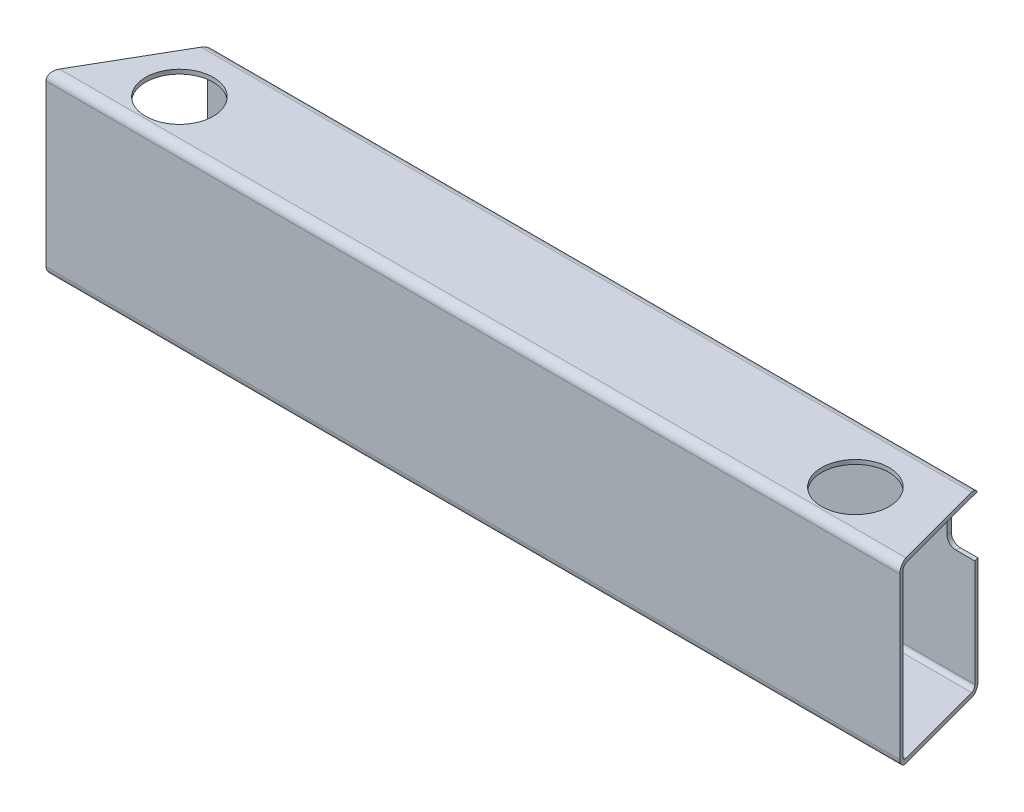
ISO-10303-21;
HEADER;
FILE_DESCRIPTION(('STEP AP214'),'2;1');
FILE_NAME('part.step','',(''),(''),'','','');
FILE_SCHEMA(('AUTOMOTIVE_DESIGN { 1 0 10303 214 1 1 1 1 }'));
ENDSEC;
DATA;
#1=APPLICATION_CONTEXT('core data for automotive mechanical design processes');
#2=APPLICATION_PROTOCOL_DEFINITION('international standard','automotive_design',2000,#1);
#3=PRODUCT_CONTEXT('',#1,'mechanical');
#4=PRODUCT('Part','Part','',(#3));
#5=PRODUCT_RELATED_PRODUCT_CATEGORY('part','',(#4));
#6=PRODUCT_DEFINITION_FORMATION('','',#4);
#7=PRODUCT_DEFINITION_CONTEXT('part definition',#1,'design');
#8=PRODUCT_DEFINITION('design','',#6,#7);
#9=PRODUCT_DEFINITION_SHAPE('','',#8);
#10=(LENGTH_UNIT() NAMED_UNIT(*) SI_UNIT(.MILLI.,.METRE.));
#11=(NAMED_UNIT(*) PLANE_ANGLE_UNIT() SI_UNIT($,.RADIAN.));
#12=(NAMED_UNIT(*) SI_UNIT($,.STERADIAN.) SOLID_ANGLE_UNIT());
#13=UNCERTAINTY_MEASURE_WITH_UNIT(LENGTH_MEASURE(1.E-05),#10,'distance_accuracy_value','');
#14=(GEOMETRIC_REPRESENTATION_CONTEXT(3) GLOBAL_UNCERTAINTY_ASSIGNED_CONTEXT((#13)) GLOBAL_UNIT_ASSIGNED_CONTEXT((#10,
#11,#12)) REPRESENTATION_CONTEXT('',''));
#15=CARTESIAN_POINT('',(0.,0.,0.));
#16=DIRECTION('',(0.,0.,1.));
#17=DIRECTION('',(1.,0.,0.));
#18=AXIS2_PLACEMENT_3D('',#15,#16,#17);
#19=CARTESIAN_POINT('',(63.5,0.,-31.75));
#20=DIRECTION('',(0.,1.,0.));
#21=DIRECTION('',(0.,0.,1.));
#22=AXIS2_PLACEMENT_3D('',#19,#20,#21);
#23=CYLINDRICAL_SURFACE('',#22,24.13);
#24=CARTESIAN_POINT('',(63.5,-123.952,-31.75));
#25=DIRECTION('',(0.,1.,0.));
#26=DIRECTION('',(0.,0.,1.));
#27=AXIS2_PLACEMENT_3D('',#24,#25,#26);
#28=CIRCLE('',#27,24.13);
#29=CARTESIAN_POINT('',(63.5,-123.952,-7.62));
#30=VERTEX_POINT('',#29);
#31=EDGE_CURVE('E269',#30,#30,#28,.F.);
#32=ORIENTED_EDGE('',*,*,#31,.F.);
#33=EDGE_LOOP('',(#32));
#34=FACE_BOUND('',#33,.T.);
#35=CARTESIAN_POINT('',(63.5,-127.,-31.75));
#36=DIRECTION('',(0.,1.,0.));
#37=DIRECTION('',(0.,0.,1.));
#38=AXIS2_PLACEMENT_3D('',#35,#36,#37);
#39=CIRCLE('',#38,24.13);
#40=CARTESIAN_POINT('',(63.5,-127.,-7.62));
#41=VERTEX_POINT('',#40);
#42=EDGE_CURVE('E20',#41,#41,#39,.T.);
#43=ORIENTED_EDGE('',*,*,#42,.F.);
#44=EDGE_LOOP('',(#43));
#45=FACE_BOUND('',#44,.T.);
#46=ADVANCED_FACE('F17',(#34,#45),#23,.F.);
#47=CARTESIAN_POINT('',(546.1,0.,-31.75));
#48=DIRECTION('',(0.,1.,0.));
#49=DIRECTION('',(0.,0.,1.));
#50=AXIS2_PLACEMENT_3D('',#47,#48,#49);
#51=CYLINDRICAL_SURFACE('',#50,24.13);
#52=CARTESIAN_POINT('',(546.1,-123.952,-31.75));
#53=DIRECTION('',(0.,1.,0.));
#54=DIRECTION('',(0.,0.,1.));
#55=AXIS2_PLACEMENT_3D('',#52,#53,#54);
#56=CIRCLE('',#55,24.13);
#57=CARTESIAN_POINT('',(546.1,-123.952,-7.62));
#58=VERTEX_POINT('',#57);
#59=EDGE_CURVE('E265',#58,#58,#56,.F.);
#60=ORIENTED_EDGE('',*,*,#59,.F.);
#61=EDGE_LOOP('',(#60));
#62=FACE_BOUND('',#61,.T.);
#63=CARTESIAN_POINT('',(546.1,-127.,-31.75));
#64=DIRECTION('',(0.,1.,0.));
#65=DIRECTION('',(0.,0.,1.));
#66=AXIS2_PLACEMENT_3D('',#63,#64,#65);
#67=CIRCLE('',#66,24.13);
#68=CARTESIAN_POINT('',(546.1,-127.,-7.62));
#69=VERTEX_POINT('',#68);
#70=EDGE_CURVE('E393',#69,#69,#67,.T.);
#71=ORIENTED_EDGE('',*,*,#70,.F.);
#72=EDGE_LOOP('',(#71));
#73=FACE_BOUND('',#72,.T.);
#74=ADVANCED_FACE('F286',(#62,#73),#51,.F.);
#75=CARTESIAN_POINT('',(63.5,0.,-31.75));
#76=DIRECTION('',(0.,1.,0.));
#77=DIRECTION('',(0.,0.,1.));
#78=AXIS2_PLACEMENT_3D('',#75,#76,#77);
#79=CYLINDRICAL_SURFACE('',#78,24.13);
#80=CARTESIAN_POINT('',(63.5,-3.048,-31.75));
#81=DIRECTION('',(0.,1.,0.));
#82=DIRECTION('',(0.,0.,1.));
#83=AXIS2_PLACEMENT_3D('',#80,#81,#82);
#84=CIRCLE('',#83,24.13);
#85=CARTESIAN_POINT('',(63.5,-3.048,-7.62));
#86=VERTEX_POINT('',#85);
#87=EDGE_CURVE('E261',#86,#86,#84,.T.);
#88=ORIENTED_EDGE('',*,*,#87,.F.);
#89=EDGE_LOOP('',(#88));
#90=FACE_BOUND('',#89,.T.);
#91=CARTESIAN_POINT('',(63.5,0.,-31.75));
#92=DIRECTION('',(0.,1.,0.));
#93=DIRECTION('',(0.,0.,1.));
#94=AXIS2_PLACEMENT_3D('',#91,#92,#93);
#95=CIRCLE('',#94,24.13);
#96=CARTESIAN_POINT('',(63.5,0.,-7.62));
#97=VERTEX_POINT('',#96);
#98=EDGE_CURVE('E168',#97,#97,#95,.F.);
#99=ORIENTED_EDGE('',*,*,#98,.F.);
#100=EDGE_LOOP('',(#99));
#101=FACE_BOUND('',#100,.T.);
#102=ADVANCED_FACE('F283',(#90,#101),#79,.F.);
#103=CARTESIAN_POINT('',(546.1,0.,-31.75));
#104=DIRECTION('',(0.,1.,0.));
#105=DIRECTION('',(0.,0.,1.));
#106=AXIS2_PLACEMENT_3D('',#103,#104,#105);
#107=CYLINDRICAL_SURFACE('',#106,24.13);
#108=CARTESIAN_POINT('',(546.1,-3.048,-31.75));
#109=DIRECTION('',(0.,1.,0.));
#110=DIRECTION('',(0.,0.,1.));
#111=AXIS2_PLACEMENT_3D('',#108,#109,#110);
#112=CIRCLE('',#111,24.13);
#113=CARTESIAN_POINT('',(546.1,-3.048,-7.62));
#114=VERTEX_POINT('',#113);
#115=EDGE_CURVE('E256',#114,#114,#112,.T.);
#116=ORIENTED_EDGE('',*,*,#115,.F.);
#117=EDGE_LOOP('',(#116));
#118=FACE_BOUND('',#117,.T.);
#119=CARTESIAN_POINT('',(546.1,0.,-31.75));
#120=DIRECTION('',(0.,1.,0.));
#121=DIRECTION('',(0.,0.,1.));
#122=AXIS2_PLACEMENT_3D('',#119,#120,#121);
#123=CIRCLE('',#122,24.13);
#124=CARTESIAN_POINT('',(546.1,0.,-7.62));
#125=VERTEX_POINT('',#124);
#126=EDGE_CURVE('E272',#125,#125,#123,.F.);
#127=ORIENTED_EDGE('',*,*,#126,.F.);
#128=EDGE_LOOP('',(#127));
#129=FACE_BOUND('',#128,.T.);
#130=ADVANCED_FACE('F285',(#118,#129),#107,.F.);
#131=CARTESIAN_POINT('',(570.132271536834,-38.1,-76.2));
#132=DIRECTION('',(-1.,0.,0.));
#133=DIRECTION('',(0.,0.,1.));
#134=AXIS2_PLACEMENT_3D('',#131,#132,#133);
#135=PLANE('',#134);
#136=DIRECTION('',(0.,1.,0.));
#137=VECTOR('',#136,1.);
#138=CARTESIAN_POINT('',(570.132271536834,-6.096,-73.152));
#139=LINE('',#138,#137);
#140=CARTESIAN_POINT('',(570.132271536834,-38.1,-73.152));
#141=VERTEX_POINT('',#140);
#142=CARTESIAN_POINT('',(570.132271536834,-9.525,-73.152));
#143=VERTEX_POINT('',#142);
#144=EDGE_CURVE('E302',#141,#143,#139,.T.);
#145=ORIENTED_EDGE('',*,*,#144,.F.);
#146=DIRECTION('',(0.,0.,-1.));
#147=VECTOR('',#146,1.);
#148=CARTESIAN_POINT('',(570.132271536834,-38.1,-76.2));
#149=LINE('',#148,#147);
#150=CARTESIAN_POINT('',(570.132271536834,-38.1,-76.2));
#151=VERTEX_POINT('',#150);
#152=EDGE_CURVE('E304',#141,#151,#149,.T.);
#153=ORIENTED_EDGE('',*,*,#152,.T.);
#154=DIRECTION('',(0.,1.,0.));
#155=VECTOR('',#154,1.);
#156=CARTESIAN_POINT('',(570.132271536834,-120.904,-76.2));
#157=LINE('',#156,#155);
#158=CARTESIAN_POINT('',(570.132271536834,-9.525,-76.2));
#159=VERTEX_POINT('',#158);
#160=EDGE_CURVE('E149',#159,#151,#157,.F.);
#161=ORIENTED_EDGE('',*,*,#160,.F.);
#162=DIRECTION('',(0.,0.,-1.));
#163=VECTOR('',#162,1.);
#164=CARTESIAN_POINT('',(570.132271536834,-9.525,-76.2));
#165=LINE('',#164,#163);
#166=EDGE_CURVE('E145',#159,#143,#165,.F.);
#167=ORIENTED_EDGE('',*,*,#166,.T.);
#168=EDGE_LOOP('',(#145,#153,#161,#167));
#169=FACE_BOUND('',#168,.T.);
#170=ADVANCED_FACE('F212',(#169),#135,.F.);
#171=CARTESIAN_POINT('',(576.482271536834,-9.525,-76.2));
#172=DIRECTION('',(0.,0.,-1.));
#173=DIRECTION('',(-1.,0.,0.));
#174=AXIS2_PLACEMENT_3D('',#171,#172,#173);
#175=CYLINDRICAL_SURFACE('',#174,6.35);
#176=DIRECTION('',(0.,0.,1.));
#177=VECTOR('',#176,1.);
#178=CARTESIAN_POINT('',(576.482271536834,-3.175,-76.2));
#179=LINE('',#178,#177);
#180=CARTESIAN_POINT('',(576.482271536834,-3.17499999999891,-75.4546051059658));
#181=VERTEX_POINT('',#180);
#182=CARTESIAN_POINT('',(576.482271536834,-3.17499999999998,-70.9746681342508));
#183=VERTEX_POINT('',#182);
#184=EDGE_CURVE('E381',#181,#183,#179,.T.);
#185=ORIENTED_EDGE('',*,*,#184,.T.);
#186=CARTESIAN_POINT('',(576.482271536834,-3.175,-70.9746681342509));
#187=CARTESIAN_POINT('',(576.410347836636,-3.17498502668541,-70.9745234173893));
#188=CARTESIAN_POINT('',(576.338553618703,-3.17622110868578,-70.9787714845352));
#189=CARTESIAN_POINT('',(576.196256395367,-3.1810514377301,-70.994779736136));
#190=CARTESIAN_POINT('',(576.125748537928,-3.18463303784486,-71.00649962394));
#191=CARTESIAN_POINT('',(575.987344215586,-3.19394112350786,-71.0359748519342));
#192=CARTESIAN_POINT('',(575.919424275209,-3.19963382177595,-71.0536347314856));
#193=CARTESIAN_POINT('',(575.785071695397,-3.21302938216495,-71.0935615478417));
#194=CARTESIAN_POINT('',(575.71864151766,-3.22073533838679,-71.1158355649338));
#195=CARTESIAN_POINT('',(575.568578251215,-3.24050200412936,-71.1705350615502));
#196=CARTESIAN_POINT('',(575.485426981871,-3.25317792013122,-71.2040458689685));
#197=CARTESIAN_POINT('',(575.321151531482,-3.28150390773572,-71.2746296058586));
#198=CARTESIAN_POINT('',(575.240028506804,-3.29715563407803,-71.3117045114978));
#199=CARTESIAN_POINT('',(574.998973785686,-3.34848027946801,-71.4262682948912));
#200=CARTESIAN_POINT('',(574.841520542321,-3.38850045749166,-71.5070298728091));
#201=CARTESIAN_POINT('',(574.52867777641,-3.48074866675603,-71.6724250247388));
#202=CARTESIAN_POINT('',(574.373371079505,-3.53317591490755,-71.75710141302));
#203=CARTESIAN_POINT('',(574.06695842303,-3.65000093826068,-71.9255074405991));
#204=CARTESIAN_POINT('',(573.915849179035,-3.71438903260737,-72.0092377878707));
#205=CARTESIAN_POINT('',(573.608442918554,-3.85982032195492,-72.1783691098207));
#206=CARTESIAN_POINT('',(573.452395423977,-3.94164233400458,-72.2635580477135));
#207=CARTESIAN_POINT('',(573.145105702442,-4.11969183057834,-72.4276122352358));
#208=CARTESIAN_POINT('',(572.993865506009,-4.21592530677616,-72.5064748336004));
#209=CARTESIAN_POINT('',(572.698850201549,-4.42203690032695,-72.6543055296642));
#210=CARTESIAN_POINT('',(572.555009455992,-4.53174620875779,-72.7233765605763));
#211=CARTESIAN_POINT('',(572.274314559328,-4.76590992153251,-72.8496946962024));
#212=CARTESIAN_POINT('',(572.137455365431,-4.89035346119435,-72.9069504288408));
#213=CARTESIAN_POINT('',(571.925463494301,-5.10113424465955,-72.9863049540959));
#214=CARTESIAN_POINT('',(571.847518575686,-5.18282762996337,-73.0133098605809));
#215=CARTESIAN_POINT('',(571.695282092811,-5.35125961463385,-73.0609104984533));
#216=CARTESIAN_POINT('',(571.620988173433,-5.43799488070459,-73.0815104083868));
#217=CARTESIAN_POINT('',(571.475664710793,-5.61733536349023,-73.1155795872494));
#218=CARTESIAN_POINT('',(571.404685701166,-5.70999902474342,-73.1289593224009));
#219=CARTESIAN_POINT('',(571.267451133607,-5.89981454224596,-73.1471767180946));
#220=CARTESIAN_POINT('',(571.201204589318,-5.99697441138802,-73.1519984743008));
#221=CARTESIAN_POINT('',(571.137698682022,-6.09600000005761,-73.152));
#222=B_SPLINE_CURVE_WITH_KNOTS('',3,(#186,#187,#188,#189,#190,#191,#192,#193,#194,#195,#196,
#197,#198,#199,#200,#201,#202,#203,#204,#205,#206,#207,#208,#209,#210,#211,#212,#213,#214,#215,
#216,#217,#218,#219,#220,#221),.UNSPECIFIED.,.F.,.F.,(4,2,2,2,2,2,2,2,2,2,2,2,2,2,2,2,2,4),(0.,
0.215429849291868,0.429707569826568,0.640694285391181,0.852007185764615,1.123430113436,
1.39500441327703,1.93868611328242,2.49177344085379,3.04441504649747,3.63092159173082,
4.21767266190772,4.7977068639638,5.37731599507503,5.72531360082258,6.0730836982466,
6.42507261591468,6.77771499527886),.UNSPECIFIED.);
#223=CARTESIAN_POINT('',(571.13769868204,-6.0960000000288,-73.152));
#224=VERTEX_POINT('',#223);
#225=EDGE_CURVE('E249',#183,#224,#222,.T.);
#226=ORIENTED_EDGE('',*,*,#225,.T.);
#227=CARTESIAN_POINT('',(576.482271536834,-9.525,-73.152));
#228=DIRECTION('',(0.,0.,-1.));
#229=DIRECTION('',(-1.,0.,0.));
#230=AXIS2_PLACEMENT_3D('',#227,#228,#229);
#231=CIRCLE('',#230,6.35);
#232=EDGE_CURVE('E257',#143,#224,#231,.T.);
#233=ORIENTED_EDGE('',*,*,#232,.F.);
#234=ORIENTED_EDGE('',*,*,#166,.F.);
#235=CARTESIAN_POINT('',(576.482271536834,-9.525,-76.2));
#236=DIRECTION('',(0.,0.,-1.));
#237=DIRECTION('',(-1.,0.,0.));
#238=AXIS2_PLACEMENT_3D('',#235,#236,#237);
#239=CIRCLE('',#238,6.35);
#240=CARTESIAN_POINT('',(571.137698682059,-6.096,-76.2));
#241=VERTEX_POINT('',#240);
#242=EDGE_CURVE('E138',#241,#159,#239,.F.);
#243=ORIENTED_EDGE('',*,*,#242,.F.);
#244=CARTESIAN_POINT('',(576.482271536834,-3.175,-75.454605105967));
#245=CARTESIAN_POINT('',(576.397060671221,-3.1749993604055,-75.4546013195659));
#246=CARTESIAN_POINT('',(576.31186211674,-3.17671552770988,-75.4555420511336));
#247=CARTESIAN_POINT('',(576.141648617018,-3.1835702931777,-75.4592769786125));
#248=CARTESIAN_POINT('',(576.056633660777,-3.18870868022954,-75.4620710601931));
#249=CARTESIAN_POINT('',(575.80226355074,-3.20922646525812,-75.4731724452976));
#250=CARTESIAN_POINT('',(575.633405084057,-3.22970853929912,-75.4841990331253));
#251=CARTESIAN_POINT('',(575.299392586321,-3.28386408549104,-75.5126992746709));
#252=CARTESIAN_POINT('',(575.134223055545,-3.31746267031612,-75.5301362963244));
#253=CARTESIAN_POINT('',(574.807668900406,-3.39748239580913,-75.5703718285367));
#254=CARTESIAN_POINT('',(574.646284912388,-3.4439056757648,-75.5931712335005));
#255=CARTESIAN_POINT('',(574.328713055043,-3.54899972897937,-75.6427152115046));
#256=CARTESIAN_POINT('',(574.172511538507,-3.60763478288508,-75.6694482133144));
#257=CARTESIAN_POINT('',(573.865615219984,-3.73679294192007,-75.7254149323563));
#258=CARTESIAN_POINT('',(573.714920446966,-3.80731610958042,-75.7546486627417));
#259=CARTESIAN_POINT('',(573.27147165715,-4.03645883905502,-75.8438993433022));
#260=CARTESIAN_POINT('',(572.987798074251,-4.21250361446833,-75.9053884553628));
#261=CARTESIAN_POINT('',(572.459070359403,-4.60154526981105,-76.017318648644));
#262=CARTESIAN_POINT('',(572.213056203793,-4.81314437228884,-76.06805542481));
#263=CARTESIAN_POINT('',(571.869628774891,-5.15781569067265,-76.12850111549));
#264=CARTESIAN_POINT('',(571.75953580574,-5.27709164256951,-76.1460280474227));
#265=CARTESIAN_POINT('',(571.548490242117,-5.5241703323363,-76.1743916857025));
#266=CARTESIAN_POINT('',(571.44753090921,-5.65196666128498,-76.1852333590862));
#267=CARTESIAN_POINT('',(571.314396989568,-5.83453090176301,-76.1946042458485));
#268=CARTESIAN_POINT('',(571.277972336855,-5.8860774186694,-76.1966074299731));
#269=CARTESIAN_POINT('',(571.206669356599,-5.99024381359084,-76.1993050623107));
#270=CARTESIAN_POINT('',(571.171790654086,-6.0428634267549,-76.1999998295955));
#271=CARTESIAN_POINT('',(571.137698682021,-6.09600000005804,-76.2));
#272=B_SPLINE_CURVE_WITH_KNOTS('',3,(#244,#245,#246,#247,#248,#249,#250,#251,#252,#253,#254,
#255,#256,#257,#258,#259,#260,#261,#262,#263,#264,#265,#266,#267,#268,#269,#270,#271),
.UNSPECIFIED.,.F.,.F.,(4,2,2,2,2,2,2,2,2,2,2,2,2,4),(0.,0.255585934995239,0.511156104737355,
1.02176424498434,1.52949878228242,2.03731806598659,2.54367233392141,3.05002926534572,
4.06415333523622,5.04509042569311,5.53438228471527,6.02331016855253,6.21272460378888,
6.40209284224635),.UNSPECIFIED.);
#273=EDGE_CURVE('E142',#181,#241,#272,.T.);
#274=ORIENTED_EDGE('',*,*,#273,.F.);
#275=EDGE_LOOP('',(#185,#226,#233,#234,#243,#274));
#276=FACE_BOUND('',#275,.T.);
#277=ADVANCED_FACE('F140',(#276),#175,.F.);
#278=CARTESIAN_POINT('',(576.482271536834,-38.1,-76.2));
#279=DIRECTION('',(0.,0.,-1.));
#280=DIRECTION('',(-1.,0.,0.));
#281=AXIS2_PLACEMENT_3D('',#278,#279,#280);
#282=CYLINDRICAL_SURFACE('',#281,6.35);
#283=CARTESIAN_POINT('',(576.482271536834,-38.1,-73.152));
#284=DIRECTION('',(0.,0.,-1.));
#285=DIRECTION('',(-1.,0.,0.));
#286=AXIS2_PLACEMENT_3D('',#283,#284,#285);
#287=CIRCLE('',#286,6.35);
#288=CARTESIAN_POINT('',(576.482271536834,-44.45,-73.152));
#289=VERTEX_POINT('',#288);
#290=EDGE_CURVE('E310',#289,#141,#287,.T.);
#291=ORIENTED_EDGE('',*,*,#290,.F.);
#292=DIRECTION('',(0.,0.,-1.));
#293=VECTOR('',#292,1.);
#294=CARTESIAN_POINT('',(576.482271536834,-44.45,-76.2));
#295=LINE('',#294,#293);
#296=CARTESIAN_POINT('',(576.482271536834,-44.45,-76.2));
#297=VERTEX_POINT('',#296);
#298=EDGE_CURVE('E313',#289,#297,#295,.T.);
#299=ORIENTED_EDGE('',*,*,#298,.T.);
#300=CARTESIAN_POINT('',(576.482271536834,-38.1,-76.2));
#301=DIRECTION('',(0.,0.,-1.));
#302=DIRECTION('',(-1.,0.,0.));
#303=AXIS2_PLACEMENT_3D('',#300,#301,#302);
#304=CIRCLE('',#303,6.35);
#305=EDGE_CURVE('E161',#151,#297,#304,.F.);
#306=ORIENTED_EDGE('',*,*,#305,.F.);
#307=ORIENTED_EDGE('',*,*,#152,.F.);
#308=EDGE_LOOP('',(#291,#299,#306,#307));
#309=FACE_BOUND('',#308,.T.);
#310=ADVANCED_FACE('F204',(#309),#282,.F.);
#311=CARTESIAN_POINT('',(592.357271536834,-44.45,-76.2));
#312=DIRECTION('',(0.,-1.,0.));
#313=DIRECTION('',(0.,0.,-1.));
#314=AXIS2_PLACEMENT_3D('',#311,#312,#313);
#315=PLANE('',#314);
#316=ORIENTED_EDGE('',*,*,#298,.F.);
#317=DIRECTION('',(1.,0.,0.));
#318=VECTOR('',#317,1.);
#319=CARTESIAN_POINT('',(0.,-44.45,-73.152));
#320=LINE('',#319,#318);
#321=CARTESIAN_POINT('',(589.998980675347,-44.45,-73.1520000000073));
#322=VERTEX_POINT('',#321);
#323=EDGE_CURVE('E317',#322,#289,#320,.F.);
#324=ORIENTED_EDGE('',*,*,#323,.F.);
#325=DIRECTION('',(0.258819045102493,0.,0.965925826289076));
#326=VECTOR('',#325,1.);
#327=CARTESIAN_POINT('',(589.182271536834,-44.45,-76.2));
#328=LINE('',#327,#326);
#329=CARTESIAN_POINT('',(589.182271536834,-44.45,-76.2));
#330=VERTEX_POINT('',#329);
#331=EDGE_CURVE('E320',#322,#330,#328,.F.);
#332=ORIENTED_EDGE('',*,*,#331,.T.);
#333=DIRECTION('',(-1.,0.,0.));
#334=VECTOR('',#333,1.);
#335=CARTESIAN_POINT('',(0.,-44.45,-76.2));
#336=LINE('',#335,#334);
#337=EDGE_CURVE('E392',#297,#330,#336,.F.);
#338=ORIENTED_EDGE('',*,*,#337,.F.);
#339=EDGE_LOOP('',(#316,#324,#332,#338));
#340=FACE_BOUND('',#339,.T.);
#341=ADVANCED_FACE('F201',(#340),#315,.F.);
#342=CARTESIAN_POINT('',(576.482271536834,-3.175,-76.2));
#343=DIRECTION('',(0.,1.,0.));
#344=DIRECTION('',(0.,0.,1.));
#345=AXIS2_PLACEMENT_3D('',#342,#343,#344);
#346=PLANE('',#345);
#347=ORIENTED_EDGE('',*,*,#184,.F.);
#348=DIRECTION('',(1.,0.,0.));
#349=VECTOR('',#348,1.);
#350=CARTESIAN_POINT('',(0.,-3.17499999999564,-75.4546051059646));
#351=LINE('',#350,#349);
#352=CARTESIAN_POINT('',(589.381999496733,-3.17499999999782,-75.4546051059658));
#353=VERTEX_POINT('',#352);
#354=EDGE_CURVE('E160',#353,#181,#351,.F.);
#355=ORIENTED_EDGE('',*,*,#354,.F.);
#356=DIRECTION('',(0.258819045102493,0.,0.965925826289076));
#357=VECTOR('',#356,1.);
#358=CARTESIAN_POINT('',(589.182271536834,-3.175,-76.2));
#359=LINE('',#358,#357);
#360=CARTESIAN_POINT('',(590.582394990446,-3.17499999999998,-70.9746681342509));
#361=VERTEX_POINT('',#360);
#362=EDGE_CURVE('E335',#353,#361,#359,.T.);
#363=ORIENTED_EDGE('',*,*,#362,.T.);
#364=DIRECTION('',(1.,0.,0.));
#365=VECTOR('',#364,1.);
#366=CARTESIAN_POINT('',(0.,-3.17499999999997,-70.9746681342508));
#367=LINE('',#366,#365);
#368=EDGE_CURVE('E308',#361,#183,#367,.F.);
#369=ORIENTED_EDGE('',*,*,#368,.T.);
#370=EDGE_LOOP('',(#347,#355,#363,#369));
#371=FACE_BOUND('',#370,.T.);
#372=ADVANCED_FACE('F197',(#371),#346,.F.);
#373=CARTESIAN_POINT('',(0.,-127.,-6.096));
#374=DIRECTION('',(0.,-1.,0.));
#375=DIRECTION('',(0.,0.,-1.));
#376=AXIS2_PLACEMENT_3D('',#373,#374,#375);
#377=PLANE('',#376);
#378=ORIENTED_EDGE('',*,*,#70,.T.);
#379=EDGE_LOOP('',(#378));
#380=FACE_BOUND('',#379,.T.);
#381=ORIENTED_EDGE('',*,*,#42,.T.);
#382=EDGE_LOOP('',(#381));
#383=FACE_BOUND('',#382,.T.);
#384=DIRECTION('',(1.,0.,0.));
#385=VECTOR('',#384,1.);
#386=CARTESIAN_POINT('',(0.,-127.,-6.096));
#387=LINE('',#386,#385);
#388=CARTESIAN_POINT('',(3.51952724098012,-127.,-6.096));
#389=VERTEX_POINT('',#388);
#390=CARTESIAN_POINT('',(607.966581723023,-127.,-6.096));
#391=VERTEX_POINT('',#390);
#392=EDGE_CURVE('E318',#389,#391,#387,.T.);
#393=ORIENTED_EDGE('',*,*,#392,.F.);
#394=DIRECTION('',(0.500000000000017,0.,-0.866025403784429));
#395=VECTOR('',#394,1.);
#396=CARTESIAN_POINT('',(0.,-127.,0.));
#397=LINE('',#396,#395);
#398=CARTESIAN_POINT('',(40.4745632712713,-127.,-70.104));
#399=VERTEX_POINT('',#398);
#400=EDGE_CURVE('E358',#389,#399,#397,.T.);
#401=ORIENTED_EDGE('',*,*,#400,.T.);
#402=DIRECTION('',(1.,0.,0.));
#403=VECTOR('',#402,1.);
#404=CARTESIAN_POINT('',(0.,-127.,-70.104));
#405=LINE('',#404,#403);
#406=CARTESIAN_POINT('',(590.815689813894,-127.,-70.104));
#407=VERTEX_POINT('',#406);
#408=EDGE_CURVE('E389',#407,#399,#405,.F.);
#409=ORIENTED_EDGE('',*,*,#408,.F.);
#410=DIRECTION('',(0.258819045102493,0.,0.965925826289076));
#411=VECTOR('',#410,1.);
#412=CARTESIAN_POINT('',(589.182271536834,-127.,-76.2));
#413=LINE('',#412,#411);
#414=EDGE_CURVE('E328',#407,#391,#413,.T.);
#415=ORIENTED_EDGE('',*,*,#414,.T.);
#416=EDGE_LOOP('',(#393,#401,#409,#415));
#417=FACE_BOUND('',#416,.T.);
#418=ADVANCED_FACE('F193',(#380,#383,#417),#377,.T.);
#419=CARTESIAN_POINT('',(0.,-120.904,-70.104));
#420=DIRECTION('',(1.,0.,0.));
#421=DIRECTION('',(0.,0.,-1.));
#422=AXIS2_PLACEMENT_3D('',#419,#420,#421);
#423=CYLINDRICAL_SURFACE('',#422,6.096);
#424=ORIENTED_EDGE('',*,*,#408,.T.);
#425=CARTESIAN_POINT('',(40.4745632712713,-120.904,-70.104));
#426=DIRECTION('',(0.866025403784429,0.,0.500000000000017));
#427=DIRECTION('',(0.500000000000017,0.,-0.866025403784429));
#428=AXIS2_PLACEMENT_3D('',#425,#426,#427);
#429=ELLIPSE('',#428,7.03905448195999,6.096);
#430=CARTESIAN_POINT('',(43.9940905122516,-120.904,-76.2000000000001));
#431=VERTEX_POINT('',#430);
#432=EDGE_CURVE('E359',#399,#431,#429,.T.);
#433=ORIENTED_EDGE('',*,*,#432,.T.);
#434=DIRECTION('',(-1.,0.,0.));
#435=VECTOR('',#434,1.);
#436=CARTESIAN_POINT('',(0.,-120.904,-76.2));
#437=LINE('',#436,#435);
#438=CARTESIAN_POINT('',(589.182271536834,-120.904,-76.2));
#439=VERTEX_POINT('',#438);
#440=EDGE_CURVE('E150',#439,#431,#437,.T.);
#441=ORIENTED_EDGE('',*,*,#440,.F.);
#442=CARTESIAN_POINT('',(590.815689813894,-120.904,-70.104));
#443=DIRECTION('',(-0.965925826289076,0.,0.258819045102493));
#444=DIRECTION('',(0.258819045102493,0.,0.965925826289076));
#445=AXIS2_PLACEMENT_3D('',#442,#443,#444);
#446=ELLIPSE('',#445,6.31104359577982,6.096);
#447=EDGE_CURVE('E325',#439,#407,#446,.T.);
#448=ORIENTED_EDGE('',*,*,#447,.T.);
#449=EDGE_LOOP('',(#424,#433,#441,#448));
#450=FACE_BOUND('',#449,.T.);
#451=ADVANCED_FACE('F190',(#450),#423,.T.);
#452=CARTESIAN_POINT('',(0.,-120.904,-76.2));
#453=DIRECTION('',(0.,0.,-1.));
#454=DIRECTION('',(-1.,0.,0.));
#455=AXIS2_PLACEMENT_3D('',#452,#453,#454);
#456=PLANE('',#455);
#457=ORIENTED_EDGE('',*,*,#160,.T.);
#458=ORIENTED_EDGE('',*,*,#305,.T.);
#459=ORIENTED_EDGE('',*,*,#337,.T.);
#460=DIRECTION('',(0.,1.,0.));
#461=VECTOR('',#460,1.);
#462=CARTESIAN_POINT('',(589.182271536834,0.,-76.2));
#463=LINE('',#462,#461);
#464=EDGE_CURVE('E329',#330,#439,#463,.F.);
#465=ORIENTED_EDGE('',*,*,#464,.T.);
#466=ORIENTED_EDGE('',*,*,#440,.T.);
#467=DIRECTION('',(0.,1.,0.));
#468=VECTOR('',#467,1.);
#469=CARTESIAN_POINT('',(43.9940905122517,0.,-76.2000000000005));
#470=LINE('',#469,#468);
#471=CARTESIAN_POINT('',(43.9940905122516,-6.096,-76.2000000000001));
#472=VERTEX_POINT('',#471);
#473=EDGE_CURVE('E157',#431,#472,#470,.T.);
#474=ORIENTED_EDGE('',*,*,#473,.T.);
#475=DIRECTION('',(1.,0.,0.));
#476=VECTOR('',#475,1.);
#477=CARTESIAN_POINT('',(0.,-6.096,-76.2));
#478=LINE('',#477,#476);
#479=EDGE_CURVE('E153',#241,#472,#478,.F.);
#480=ORIENTED_EDGE('',*,*,#479,.F.);
#481=ORIENTED_EDGE('',*,*,#242,.T.);
#482=EDGE_LOOP('',(#457,#458,#459,#465,#466,#474,#480,#481));
#483=FACE_BOUND('',#482,.T.);
#484=ADVANCED_FACE('F154',(#483),#456,.T.);
#485=CARTESIAN_POINT('',(0.,-6.096,-70.104));
#486=DIRECTION('',(1.,0.,0.));
#487=DIRECTION('',(0.,0.,-1.));
#488=AXIS2_PLACEMENT_3D('',#485,#486,#487);
#489=CYLINDRICAL_SURFACE('',#488,6.096);
#490=ORIENTED_EDGE('',*,*,#354,.T.);
#491=ORIENTED_EDGE('',*,*,#273,.T.);
#492=ORIENTED_EDGE('',*,*,#479,.T.);
#493=CARTESIAN_POINT('',(40.4745632712713,-6.096,-70.104));
#494=DIRECTION('',(0.866025403784429,0.,0.500000000000017));
#495=DIRECTION('',(0.500000000000017,0.,-0.866025403784429));
#496=AXIS2_PLACEMENT_3D('',#493,#494,#495);
#497=ELLIPSE('',#496,7.03905448195999,6.096);
#498=CARTESIAN_POINT('',(40.4745632712713,0.,-70.104));
#499=VERTEX_POINT('',#498);
#500=EDGE_CURVE('E361',#472,#499,#497,.T.);
#501=ORIENTED_EDGE('',*,*,#500,.T.);
#502=DIRECTION('',(1.,0.,0.));
#503=VECTOR('',#502,1.);
#504=CARTESIAN_POINT('',(0.,0.,-70.104));
#505=LINE('',#504,#503);
#506=CARTESIAN_POINT('',(590.815689813894,0.,-70.104));
#507=VERTEX_POINT('',#506);
#508=EDGE_CURVE('E165',#507,#499,#505,.F.);
#509=ORIENTED_EDGE('',*,*,#508,.F.);
#510=CARTESIAN_POINT('',(590.815689813894,-6.096,-70.104));
#511=DIRECTION('',(-0.965925826289076,0.,0.258819045102493));
#512=DIRECTION('',(0.258819045102493,0.,0.965925826289076));
#513=AXIS2_PLACEMENT_3D('',#510,#511,#512);
#514=ELLIPSE('',#513,6.31104359577982,6.096);
#515=EDGE_CURVE('E333',#507,#353,#514,.T.);
#516=ORIENTED_EDGE('',*,*,#515,.T.);
#517=EDGE_LOOP('',(#490,#491,#492,#501,#509,#516));
#518=FACE_BOUND('',#517,.T.);
#519=ADVANCED_FACE('F163',(#518),#489,.T.);
#520=CARTESIAN_POINT('',(0.,0.,-70.104));
#521=DIRECTION('',(0.,1.,0.));
#522=DIRECTION('',(0.,0.,1.));
#523=AXIS2_PLACEMENT_3D('',#520,#521,#522);
#524=PLANE('',#523);
#525=ORIENTED_EDGE('',*,*,#126,.T.);
#526=EDGE_LOOP('',(#525));
#527=FACE_BOUND('',#526,.T.);
#528=ORIENTED_EDGE('',*,*,#98,.T.);
#529=EDGE_LOOP('',(#528));
#530=FACE_BOUND('',#529,.T.);
#531=ORIENTED_EDGE('',*,*,#508,.T.);
#532=DIRECTION('',(0.500000000000017,0.,-0.866025403784429));
#533=VECTOR('',#532,1.);
#534=CARTESIAN_POINT('',(0.,0.,0.));
#535=LINE('',#534,#533);
#536=CARTESIAN_POINT('',(3.51952724098012,0.,-6.096));
#537=VERTEX_POINT('',#536);
#538=EDGE_CURVE('E363',#499,#537,#535,.F.);
#539=ORIENTED_EDGE('',*,*,#538,.T.);
#540=DIRECTION('',(1.,0.,0.));
#541=VECTOR('',#540,1.);
#542=CARTESIAN_POINT('',(0.,0.,-6.096));
#543=LINE('',#542,#541);
#544=CARTESIAN_POINT('',(607.966581723023,0.,-6.096));
#545=VERTEX_POINT('',#544);
#546=EDGE_CURVE('E354',#545,#537,#543,.F.);
#547=ORIENTED_EDGE('',*,*,#546,.F.);
#548=DIRECTION('',(0.258819045102493,0.,0.965925826289076));
#549=VECTOR('',#548,1.);
#550=CARTESIAN_POINT('',(589.182271536834,0.,-76.2));
#551=LINE('',#550,#549);
#552=EDGE_CURVE('E332',#545,#507,#551,.F.);
#553=ORIENTED_EDGE('',*,*,#552,.T.);
#554=EDGE_LOOP('',(#531,#539,#547,#553));
#555=FACE_BOUND('',#554,.T.);
#556=ADVANCED_FACE('F186',(#527,#530,#555),#524,.T.);
#557=CARTESIAN_POINT('',(0.,-120.904,-70.104));
#558=DIRECTION('',(1.,0.,0.));
#559=DIRECTION('',(0.,0.,-1.));
#560=AXIS2_PLACEMENT_3D('',#557,#558,#559);
#561=CYLINDRICAL_SURFACE('',#560,3.048);
#562=CARTESIAN_POINT('',(590.815689813894,-120.904,-70.104));
#563=DIRECTION('',(-0.965925826289076,0.,0.258819045102493));
#564=DIRECTION('',(0.258819045102493,0.,0.965925826289076));
#565=AXIS2_PLACEMENT_3D('',#562,#563,#564);
#566=ELLIPSE('',#565,3.15552179788991,3.048);
#567=CARTESIAN_POINT('',(590.815689813894,-123.952,-70.104));
#568=VERTEX_POINT('',#567);
#569=CARTESIAN_POINT('',(589.998980675363,-120.904,-73.1520000000027));
#570=VERTEX_POINT('',#569);
#571=EDGE_CURVE('E348',#568,#570,#566,.F.);
#572=ORIENTED_EDGE('',*,*,#571,.T.);
#573=DIRECTION('',(1.,0.,0.));
#574=VECTOR('',#573,1.);
#575=CARTESIAN_POINT('',(0.,-120.904,-73.152));
#576=LINE('',#575,#574);
#577=CARTESIAN_POINT('',(42.2343268917608,-120.904,-73.1519999999994));
#578=VERTEX_POINT('',#577);
#579=EDGE_CURVE('E322',#578,#570,#576,.T.);
#580=ORIENTED_EDGE('',*,*,#579,.F.);
#581=CARTESIAN_POINT('',(40.4745632712713,-120.904,-70.104));
#582=DIRECTION('',(0.866025403784429,0.,0.500000000000017));
#583=DIRECTION('',(0.500000000000017,0.,-0.866025403784429));
#584=AXIS2_PLACEMENT_3D('',#581,#582,#583);
#585=ELLIPSE('',#584,3.51952724098,3.048);
#586=CARTESIAN_POINT('',(40.4745632712713,-123.952,-70.104));
#587=VERTEX_POINT('',#586);
#588=EDGE_CURVE('E365',#578,#587,#585,.F.);
#589=ORIENTED_EDGE('',*,*,#588,.T.);
#590=DIRECTION('',(1.,0.,0.));
#591=VECTOR('',#590,1.);
#592=CARTESIAN_POINT('',(0.,-123.952,-70.104));
#593=LINE('',#592,#591);
#594=EDGE_CURVE('E271',#568,#587,#593,.F.);
#595=ORIENTED_EDGE('',*,*,#594,.F.);
#596=EDGE_LOOP('',(#572,#580,#589,#595));
#597=FACE_BOUND('',#596,.T.);
#598=ADVANCED_FACE('F467',(#597),#561,.F.);
#599=CARTESIAN_POINT('',(0.,-123.952,-70.104));
#600=DIRECTION('',(0.,1.,0.));
#601=DIRECTION('',(0.,0.,1.));
#602=AXIS2_PLACEMENT_3D('',#599,#600,#601);
#603=PLANE('',#602);
#604=ORIENTED_EDGE('',*,*,#59,.T.);
#605=EDGE_LOOP('',(#604));
#606=FACE_BOUND('',#605,.T.);
#607=ORIENTED_EDGE('',*,*,#31,.T.);
#608=EDGE_LOOP('',(#607));
#609=FACE_BOUND('',#608,.T.);
#610=ORIENTED_EDGE('',*,*,#594,.T.);
#611=DIRECTION('',(0.500000000000017,0.,-0.866025403784429));
#612=VECTOR('',#611,1.);
#613=CARTESIAN_POINT('',(0.,-123.952,0.));
#614=LINE('',#613,#612);
#615=CARTESIAN_POINT('',(3.51952724098012,-123.952,-6.096));
#616=VERTEX_POINT('',#615);
#617=EDGE_CURVE('E368',#587,#616,#614,.F.);
#618=ORIENTED_EDGE('',*,*,#617,.T.);
#619=DIRECTION('',(1.,0.,0.));
#620=VECTOR('',#619,1.);
#621=CARTESIAN_POINT('',(0.,-123.952,-6.096));
#622=LINE('',#621,#620);
#623=CARTESIAN_POINT('',(607.966581723023,-123.952,-6.096));
#624=VERTEX_POINT('',#623);
#625=EDGE_CURVE('E268',#616,#624,#622,.T.);
#626=ORIENTED_EDGE('',*,*,#625,.T.);
#627=DIRECTION('',(0.258819045102493,0.,0.965925826289076));
#628=VECTOR('',#627,1.);
#629=CARTESIAN_POINT('',(589.182271536834,-123.952,-76.2));
#630=LINE('',#629,#628);
#631=EDGE_CURVE('E347',#624,#568,#630,.F.);
#632=ORIENTED_EDGE('',*,*,#631,.T.);
#633=EDGE_LOOP('',(#610,#618,#626,#632));
#634=FACE_BOUND('',#633,.T.);
#635=ADVANCED_FACE('F470',(#606,#609,#634),#603,.T.);
#636=CARTESIAN_POINT('',(0.,-120.904,-6.096));
#637=DIRECTION('',(1.,0.,0.));
#638=DIRECTION('',(0.,0.,-1.));
#639=AXIS2_PLACEMENT_3D('',#636,#637,#638);
#640=CYLINDRICAL_SURFACE('',#639,3.048);
#641=CARTESIAN_POINT('',(607.966581723023,-120.904,-6.096));
#642=DIRECTION('',(-0.965925826289076,0.,0.258819045102493));
#643=DIRECTION('',(0.258819045102493,0.,0.965925826289076));
#644=AXIS2_PLACEMENT_3D('',#641,#642,#643);
#645=ELLIPSE('',#644,3.15552179788991,3.048);
#646=CARTESIAN_POINT('',(608.783290861552,-120.904,-3.04800000000244));
#647=VERTEX_POINT('',#646);
#648=EDGE_CURVE('E344',#647,#624,#645,.F.);
#649=ORIENTED_EDGE('',*,*,#648,.T.);
#650=ORIENTED_EDGE('',*,*,#625,.F.);
#651=CARTESIAN_POINT('',(3.51952724098012,-120.904,-6.096));
#652=DIRECTION('',(0.866025403784429,0.,0.500000000000017));
#653=DIRECTION('',(0.500000000000017,0.,-0.866025403784429));
#654=AXIS2_PLACEMENT_3D('',#651,#652,#653);
#655=ELLIPSE('',#654,3.51952724098,3.048);
#656=CARTESIAN_POINT('',(1.75976362049006,-120.904,-3.048));
#657=VERTEX_POINT('',#656);
#658=EDGE_CURVE('E369',#616,#657,#655,.F.);
#659=ORIENTED_EDGE('',*,*,#658,.T.);
#660=DIRECTION('',(-1.,0.,0.));
#661=VECTOR('',#660,1.);
#662=CARTESIAN_POINT('',(0.,-120.904,-3.048));
#663=LINE('',#662,#661);
#664=EDGE_CURVE('E401',#647,#657,#663,.T.);
#665=ORIENTED_EDGE('',*,*,#664,.F.);
#666=EDGE_LOOP('',(#649,#650,#659,#665));
#667=FACE_BOUND('',#666,.T.);
#668=ADVANCED_FACE('F490',(#667),#640,.F.);
#669=CARTESIAN_POINT('',(0.,-120.904,-3.048));
#670=DIRECTION('',(0.,0.,-1.));
#671=DIRECTION('',(-1.,0.,0.));
#672=AXIS2_PLACEMENT_3D('',#669,#670,#671);
#673=PLANE('',#672);
#674=ORIENTED_EDGE('',*,*,#664,.T.);
#675=DIRECTION('',(0.,1.,0.));
#676=VECTOR('',#675,1.);
#677=CARTESIAN_POINT('',(1.75976362049007,0.,-3.04800000000002));
#678=LINE('',#677,#676);
#679=CARTESIAN_POINT('',(1.75976362049006,-6.096,-3.048));
#680=VERTEX_POINT('',#679);
#681=EDGE_CURVE('E372',#657,#680,#678,.T.);
#682=ORIENTED_EDGE('',*,*,#681,.T.);
#683=DIRECTION('',(1.,0.,0.));
#684=VECTOR('',#683,1.);
#685=CARTESIAN_POINT('',(0.,-6.096,-3.048));
#686=LINE('',#685,#684);
#687=CARTESIAN_POINT('',(608.783290861552,-6.096,-3.04800000000244));
#688=VERTEX_POINT('',#687);
#689=EDGE_CURVE('E404',#680,#688,#686,.T.);
#690=ORIENTED_EDGE('',*,*,#689,.T.);
#691=DIRECTION('',(0.,1.,0.));
#692=VECTOR('',#691,1.);
#693=CARTESIAN_POINT('',(608.783290861551,0.,-3.04800000000978));
#694=LINE('',#693,#692);
#695=EDGE_CURVE('E343',#688,#647,#694,.F.);
#696=ORIENTED_EDGE('',*,*,#695,.T.);
#697=EDGE_LOOP('',(#674,#682,#690,#696));
#698=FACE_BOUND('',#697,.T.);
#699=ADVANCED_FACE('F493',(#698),#673,.T.);
#700=CARTESIAN_POINT('',(0.,-6.096,-6.096));
#701=DIRECTION('',(1.,0.,0.));
#702=DIRECTION('',(0.,0.,-1.));
#703=AXIS2_PLACEMENT_3D('',#700,#701,#702);
#704=CYLINDRICAL_SURFACE('',#703,3.048);
#705=CARTESIAN_POINT('',(607.966581723023,-6.096,-6.096));
#706=DIRECTION('',(-0.965925826289076,0.,0.258819045102493));
#707=DIRECTION('',(0.258819045102493,0.,0.965925826289076));
#708=AXIS2_PLACEMENT_3D('',#705,#706,#707);
#709=ELLIPSE('',#708,3.15552179788991,3.048);
#710=CARTESIAN_POINT('',(607.966581723023,-3.048,-6.096));
#711=VERTEX_POINT('',#710);
#712=EDGE_CURVE('E340',#711,#688,#709,.F.);
#713=ORIENTED_EDGE('',*,*,#712,.T.);
#714=ORIENTED_EDGE('',*,*,#689,.F.);
#715=CARTESIAN_POINT('',(3.51952724098012,-6.096,-6.096));
#716=DIRECTION('',(0.866025403784429,0.,0.500000000000017));
#717=DIRECTION('',(0.500000000000017,0.,-0.866025403784429));
#718=AXIS2_PLACEMENT_3D('',#715,#716,#717);
#719=ELLIPSE('',#718,3.51952724098,3.048);
#720=CARTESIAN_POINT('',(3.51952724098012,-3.048,-6.096));
#721=VERTEX_POINT('',#720);
#722=EDGE_CURVE('E373',#680,#721,#719,.F.);
#723=ORIENTED_EDGE('',*,*,#722,.T.);
#724=DIRECTION('',(1.,0.,0.));
#725=VECTOR('',#724,1.);
#726=CARTESIAN_POINT('',(0.,-3.048,-6.096));
#727=LINE('',#726,#725);
#728=EDGE_CURVE('E264',#711,#721,#727,.F.);
#729=ORIENTED_EDGE('',*,*,#728,.F.);
#730=EDGE_LOOP('',(#713,#714,#723,#729));
#731=FACE_BOUND('',#730,.T.);
#732=ADVANCED_FACE('F499',(#731),#704,.F.);
#733=CARTESIAN_POINT('',(0.,-3.048,-6.096));
#734=DIRECTION('',(0.,-1.,0.));
#735=DIRECTION('',(0.,0.,-1.));
#736=AXIS2_PLACEMENT_3D('',#733,#734,#735);
#737=PLANE('',#736);
#738=ORIENTED_EDGE('',*,*,#115,.T.);
#739=EDGE_LOOP('',(#738));
#740=FACE_BOUND('',#739,.T.);
#741=ORIENTED_EDGE('',*,*,#87,.T.);
#742=EDGE_LOOP('',(#741));
#743=FACE_BOUND('',#742,.T.);
#744=ORIENTED_EDGE('',*,*,#728,.T.);
#745=DIRECTION('',(0.500000000000017,0.,-0.866025403784429));
#746=VECTOR('',#745,1.);
#747=CARTESIAN_POINT('',(0.,-3.048,0.));
#748=LINE('',#747,#746);
#749=CARTESIAN_POINT('',(40.4745632712713,-3.048,-70.104));
#750=VERTEX_POINT('',#749);
#751=EDGE_CURVE('E376',#721,#750,#748,.T.);
#752=ORIENTED_EDGE('',*,*,#751,.T.);
#753=DIRECTION('',(1.,0.,0.));
#754=VECTOR('',#753,1.);
#755=CARTESIAN_POINT('',(0.,-3.048,-70.104));
#756=LINE('',#755,#754);
#757=CARTESIAN_POINT('',(590.815689813894,-3.048,-70.104));
#758=VERTEX_POINT('',#757);
#759=EDGE_CURVE('E255',#750,#758,#756,.T.);
#760=ORIENTED_EDGE('',*,*,#759,.T.);
#761=DIRECTION('',(0.258819045102493,0.,0.965925826289076));
#762=VECTOR('',#761,1.);
#763=CARTESIAN_POINT('',(589.182271536834,-3.048,-76.2));
#764=LINE('',#763,#762);
#765=EDGE_CURVE('E339',#758,#711,#764,.T.);
#766=ORIENTED_EDGE('',*,*,#765,.T.);
#767=EDGE_LOOP('',(#744,#752,#760,#766));
#768=FACE_BOUND('',#767,.T.);
#769=ADVANCED_FACE('F245',(#740,#743,#768),#737,.T.);
#770=CARTESIAN_POINT('',(0.,-6.096,-70.104));
#771=DIRECTION('',(1.,0.,0.));
#772=DIRECTION('',(0.,0.,-1.));
#773=AXIS2_PLACEMENT_3D('',#770,#771,#772);
#774=CYLINDRICAL_SURFACE('',#773,3.048);
#775=CARTESIAN_POINT('',(590.815689813894,-6.096,-70.104));
#776=DIRECTION('',(-0.965925826289076,0.,0.258819045102493));
#777=DIRECTION('',(0.258819045102493,0.,0.965925826289076));
#778=AXIS2_PLACEMENT_3D('',#775,#776,#777);
#779=ELLIPSE('',#778,3.15552179788991,3.048);
#780=EDGE_CURVE('E336',#361,#758,#779,.F.);
#781=ORIENTED_EDGE('',*,*,#780,.T.);
#782=ORIENTED_EDGE('',*,*,#759,.F.);
#783=CARTESIAN_POINT('',(40.4745632712713,-6.096,-70.104));
#784=DIRECTION('',(0.866025403784429,0.,0.500000000000017));
#785=DIRECTION('',(0.500000000000017,0.,-0.866025403784429));
#786=AXIS2_PLACEMENT_3D('',#783,#784,#785);
#787=ELLIPSE('',#786,3.51952724098,3.048);
#788=CARTESIAN_POINT('',(42.2343268917608,-6.096,-73.1519999999994));
#789=VERTEX_POINT('',#788);
#790=EDGE_CURVE('E377',#750,#789,#787,.F.);
#791=ORIENTED_EDGE('',*,*,#790,.T.);
#792=DIRECTION('',(1.,0.,0.));
#793=VECTOR('',#792,1.);
#794=CARTESIAN_POINT('',(0.,-6.096,-73.152));
#795=LINE('',#794,#793);
#796=EDGE_CURVE('E412',#224,#789,#795,.F.);
#797=ORIENTED_EDGE('',*,*,#796,.F.);
#798=ORIENTED_EDGE('',*,*,#225,.F.);
#799=ORIENTED_EDGE('',*,*,#368,.F.);
#800=EDGE_LOOP('',(#781,#782,#791,#797,#798,#799));
#801=FACE_BOUND('',#800,.T.);
#802=ADVANCED_FACE('F240',(#801),#774,.F.);
#803=CARTESIAN_POINT('',(0.,-6.096,-73.152));
#804=DIRECTION('',(0.,0.,1.));
#805=DIRECTION('',(1.,0.,0.));
#806=AXIS2_PLACEMENT_3D('',#803,#804,#805);
#807=PLANE('',#806);
#808=ORIENTED_EDGE('',*,*,#323,.T.);
#809=ORIENTED_EDGE('',*,*,#290,.T.);
#810=ORIENTED_EDGE('',*,*,#144,.T.);
#811=ORIENTED_EDGE('',*,*,#232,.T.);
#812=ORIENTED_EDGE('',*,*,#796,.T.);
#813=DIRECTION('',(0.,1.,0.));
#814=VECTOR('',#813,1.);
#815=CARTESIAN_POINT('',(42.2343268917601,0.,-73.1519999999978));
#816=LINE('',#815,#814);
#817=EDGE_CURVE('E380',#789,#578,#816,.F.);
#818=ORIENTED_EDGE('',*,*,#817,.T.);
#819=ORIENTED_EDGE('',*,*,#579,.T.);
#820=DIRECTION('',(0.,1.,0.));
#821=VECTOR('',#820,1.);
#822=CARTESIAN_POINT('',(589.998980675361,0.,-73.152000000011));
#823=LINE('',#822,#821);
#824=EDGE_CURVE('E350',#570,#322,#823,.T.);
#825=ORIENTED_EDGE('',*,*,#824,.T.);
#826=EDGE_LOOP('',(#808,#809,#810,#811,#812,#818,#819,#825));
#827=FACE_BOUND('',#826,.T.);
#828=ADVANCED_FACE('F236',(#827),#807,.T.);
#829=CARTESIAN_POINT('',(0.,-120.904,-6.096));
#830=DIRECTION('',(1.,0.,0.));
#831=DIRECTION('',(0.,0.,-1.));
#832=AXIS2_PLACEMENT_3D('',#829,#830,#831);
#833=CYLINDRICAL_SURFACE('',#832,6.096);
#834=DIRECTION('',(1.,0.,0.));
#835=VECTOR('',#834,1.);
#836=CARTESIAN_POINT('',(0.,-120.904,0.));
#837=LINE('',#836,#835);
#838=CARTESIAN_POINT('',(0.,-120.904,0.));
#839=VERTEX_POINT('',#838);
#840=CARTESIAN_POINT('',(609.600000000042,-120.904,0.));
#841=VERTEX_POINT('',#840);
#842=EDGE_CURVE('E438',#839,#841,#837,.T.);
#843=ORIENTED_EDGE('',*,*,#842,.F.);
#844=CARTESIAN_POINT('',(3.51952724098012,-120.904,-6.096));
#845=DIRECTION('',(0.866025403784429,0.,0.500000000000017));
#846=DIRECTION('',(0.500000000000017,0.,-0.866025403784429));
#847=AXIS2_PLACEMENT_3D('',#844,#845,#846);
#848=ELLIPSE('',#847,7.03905448195999,6.096);
#849=EDGE_CURVE('E355',#839,#389,#848,.T.);
#850=ORIENTED_EDGE('',*,*,#849,.T.);
#851=ORIENTED_EDGE('',*,*,#392,.T.);
#852=CARTESIAN_POINT('',(607.966581723023,-120.904,-6.096));
#853=DIRECTION('',(-0.965925826289076,0.,0.258819045102493));
#854=DIRECTION('',(0.258819045102493,0.,0.965925826289076));
#855=AXIS2_PLACEMENT_3D('',#852,#853,#854);
#856=ELLIPSE('',#855,6.31104359577982,6.096);
#857=EDGE_CURVE('E330',#391,#841,#856,.T.);
#858=ORIENTED_EDGE('',*,*,#857,.T.);
#859=EDGE_LOOP('',(#843,#850,#851,#858));
#860=FACE_BOUND('',#859,.T.);
#861=ADVANCED_FACE('F232',(#860),#833,.T.);
#862=CARTESIAN_POINT('',(589.182271536834,0.,-76.2));
#863=DIRECTION('',(-0.965925826289076,0.,0.258819045102493));
#864=DIRECTION('',(0.258819045102493,0.,0.965925826289076));
#865=AXIS2_PLACEMENT_3D('',#862,#863,#864);
#866=PLANE('',#865);
#867=ORIENTED_EDGE('',*,*,#571,.F.);
#868=ORIENTED_EDGE('',*,*,#631,.F.);
#869=ORIENTED_EDGE('',*,*,#648,.F.);
#870=ORIENTED_EDGE('',*,*,#695,.F.);
#871=ORIENTED_EDGE('',*,*,#712,.F.);
#872=ORIENTED_EDGE('',*,*,#765,.F.);
#873=ORIENTED_EDGE('',*,*,#780,.F.);
#874=ORIENTED_EDGE('',*,*,#362,.F.);
#875=ORIENTED_EDGE('',*,*,#515,.F.);
#876=ORIENTED_EDGE('',*,*,#552,.F.);
#877=CARTESIAN_POINT('',(607.966581723023,-6.096,-6.096));
#878=DIRECTION('',(-0.965925826289076,0.,0.258819045102493));
#879=DIRECTION('',(0.258819045102493,0.,0.965925826289076));
#880=AXIS2_PLACEMENT_3D('',#877,#878,#879);
#881=ELLIPSE('',#880,6.31104359577982,6.096);
#882=CARTESIAN_POINT('',(609.600000000042,-6.096,0.));
#883=VERTEX_POINT('',#882);
#884=EDGE_CURVE('E351',#883,#545,#881,.T.);
#885=ORIENTED_EDGE('',*,*,#884,.F.);
#886=DIRECTION('',(0.,1.,0.));
#887=VECTOR('',#886,1.);
#888=CARTESIAN_POINT('',(609.6,-6.096,0.));
#889=LINE('',#888,#887);
#890=EDGE_CURVE('E435',#841,#883,#889,.T.);
#891=ORIENTED_EDGE('',*,*,#890,.F.);
#892=ORIENTED_EDGE('',*,*,#857,.F.);
#893=ORIENTED_EDGE('',*,*,#414,.F.);
#894=ORIENTED_EDGE('',*,*,#447,.F.);
#895=ORIENTED_EDGE('',*,*,#464,.F.);
#896=ORIENTED_EDGE('',*,*,#331,.F.);
#897=ORIENTED_EDGE('',*,*,#824,.F.);
#898=EDGE_LOOP('',(#867,#868,#869,#870,#871,#872,#873,#874,#875,#876,#885,#891,#892,#893,#894,
#895,#896,#897));
#899=FACE_BOUND('',#898,.T.);
#900=ADVANCED_FACE('F229',(#899),#866,.F.);
#901=CARTESIAN_POINT('',(0.,-6.096,-6.096));
#902=DIRECTION('',(1.,0.,0.));
#903=DIRECTION('',(0.,0.,-1.));
#904=AXIS2_PLACEMENT_3D('',#901,#902,#903);
#905=CYLINDRICAL_SURFACE('',#904,6.096);
#906=ORIENTED_EDGE('',*,*,#546,.T.);
#907=CARTESIAN_POINT('',(3.51952724098012,-6.096,-6.096));
#908=DIRECTION('',(0.866025403784429,0.,0.500000000000017));
#909=DIRECTION('',(0.500000000000017,0.,-0.866025403784429));
#910=AXIS2_PLACEMENT_3D('',#907,#908,#909);
#911=ELLIPSE('',#910,7.03905448195999,6.096);
#912=CARTESIAN_POINT('',(0.,-6.096,0.));
#913=VERTEX_POINT('',#912);
#914=EDGE_CURVE('E35',#537,#913,#911,.T.);
#915=ORIENTED_EDGE('',*,*,#914,.T.);
#916=DIRECTION('',(1.,0.,0.));
#917=VECTOR('',#916,1.);
#918=CARTESIAN_POINT('',(0.,-6.096,0.));
#919=LINE('',#918,#917);
#920=EDGE_CURVE('E26',#883,#913,#919,.F.);
#921=ORIENTED_EDGE('',*,*,#920,.F.);
#922=ORIENTED_EDGE('',*,*,#884,.T.);
#923=EDGE_LOOP('',(#906,#915,#921,#922));
#924=FACE_BOUND('',#923,.T.);
#925=ADVANCED_FACE('F222',(#924),#905,.T.);
#926=CARTESIAN_POINT('',(0.,0.,0.));
#927=DIRECTION('',(0.866025403784429,0.,0.500000000000017));
#928=DIRECTION('',(0.500000000000017,0.,-0.866025403784429));
#929=AXIS2_PLACEMENT_3D('',#926,#927,#928);
#930=PLANE('',#929);
#931=ORIENTED_EDGE('',*,*,#790,.F.);
#932=ORIENTED_EDGE('',*,*,#751,.F.);
#933=ORIENTED_EDGE('',*,*,#722,.F.);
#934=ORIENTED_EDGE('',*,*,#681,.F.);
#935=ORIENTED_EDGE('',*,*,#658,.F.);
#936=ORIENTED_EDGE('',*,*,#617,.F.);
#937=ORIENTED_EDGE('',*,*,#588,.F.);
#938=ORIENTED_EDGE('',*,*,#817,.F.);
#939=EDGE_LOOP('',(#931,#932,#933,#934,#935,#936,#937,#938));
#940=FACE_BOUND('',#939,.T.);
#941=ORIENTED_EDGE('',*,*,#914,.F.);
#942=ORIENTED_EDGE('',*,*,#538,.F.);
#943=ORIENTED_EDGE('',*,*,#500,.F.);
#944=ORIENTED_EDGE('',*,*,#473,.F.);
#945=ORIENTED_EDGE('',*,*,#432,.F.);
#946=ORIENTED_EDGE('',*,*,#400,.F.);
#947=ORIENTED_EDGE('',*,*,#849,.F.);
#948=DIRECTION('',(0.,1.,0.));
#949=VECTOR('',#948,1.);
#950=CARTESIAN_POINT('',(0.,-6.096,0.));
#951=LINE('',#950,#949);
#952=EDGE_CURVE('E11',#913,#839,#951,.F.);
#953=ORIENTED_EDGE('',*,*,#952,.F.);
#954=EDGE_LOOP('',(#941,#942,#943,#944,#945,#946,#947,#953));
#955=FACE_BOUND('',#954,.T.);
#956=ADVANCED_FACE('F216',(#940,#955),#930,.F.);
#957=CARTESIAN_POINT('',(0.,-6.096,0.));
#958=DIRECTION('',(0.,0.,1.));
#959=DIRECTION('',(1.,0.,0.));
#960=AXIS2_PLACEMENT_3D('',#957,#958,#959);
#961=PLANE('',#960);
#962=ORIENTED_EDGE('',*,*,#920,.T.);
#963=ORIENTED_EDGE('',*,*,#952,.T.);
#964=ORIENTED_EDGE('',*,*,#842,.T.);
#965=ORIENTED_EDGE('',*,*,#890,.T.);
#966=EDGE_LOOP('',(#962,#963,#964,#965));
#967=FACE_BOUND('',#966,.T.);
#968=ADVANCED_FACE('F214',(#967),#961,.T.);
#969=CLOSED_SHELL('',(#46,#74,#102,#130,#170,#277,#310,#341,#372,#418,#451,#484,#519,#556,#598,
#635,#668,#699,#732,#769,#802,#828,#861,#900,#925,#956,#968));
#970=MANIFOLD_SOLID_BREP('B1',#969);
#971=ADVANCED_BREP_SHAPE_REPRESENTATION('',(#18,#970),#14);
#972=SHAPE_DEFINITION_REPRESENTATION(#9,#971);
ENDSEC;
END-ISO-10303-21;
